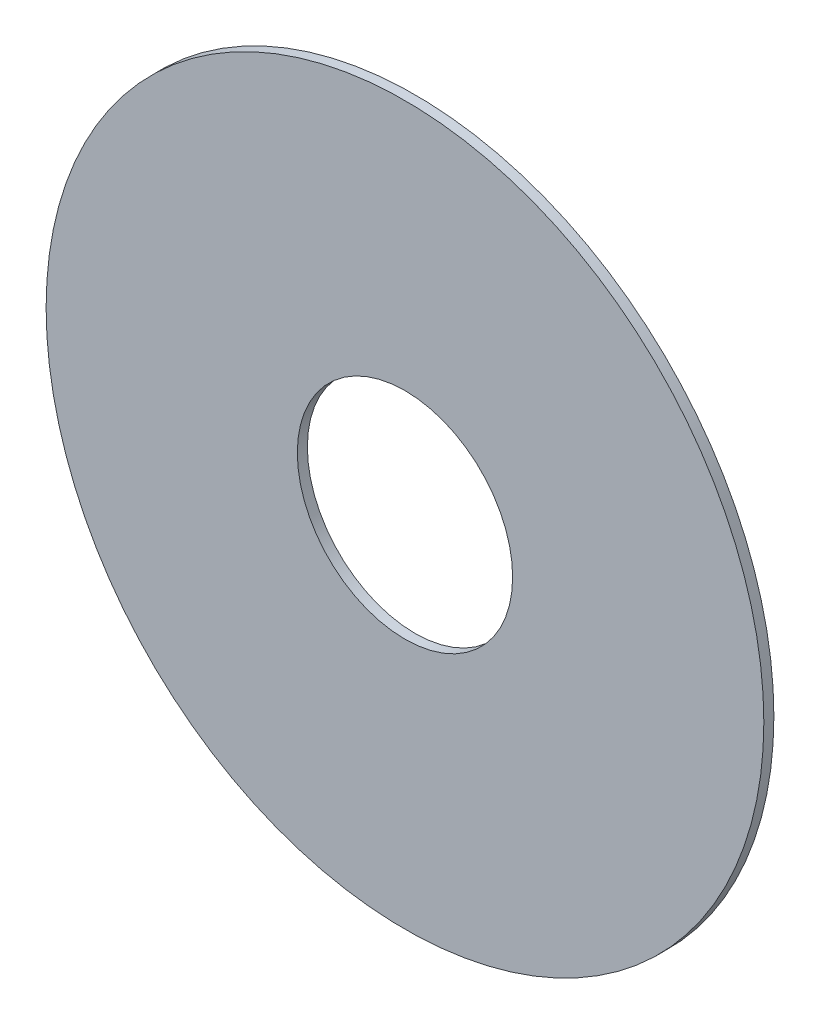
ISO-10303-21;
HEADER;
FILE_DESCRIPTION(('STEP AP214'),'2;1');
FILE_NAME('part.step','',(''),(''),'','','');
FILE_SCHEMA(('AUTOMOTIVE_DESIGN { 1 0 10303 214 1 1 1 1 }'));
ENDSEC;
DATA;
#1=APPLICATION_CONTEXT('core data for automotive mechanical design processes');
#2=APPLICATION_PROTOCOL_DEFINITION('international standard','automotive_design',2000,#1);
#3=PRODUCT_CONTEXT('',#1,'mechanical');
#4=PRODUCT('Part','Part','',(#3));
#5=PRODUCT_RELATED_PRODUCT_CATEGORY('part','',(#4));
#6=PRODUCT_DEFINITION_FORMATION('','',#4);
#7=PRODUCT_DEFINITION_CONTEXT('part definition',#1,'design');
#8=PRODUCT_DEFINITION('design','',#6,#7);
#9=PRODUCT_DEFINITION_SHAPE('','',#8);
#10=(LENGTH_UNIT() NAMED_UNIT(*) SI_UNIT(.MILLI.,.METRE.));
#11=(NAMED_UNIT(*) PLANE_ANGLE_UNIT() SI_UNIT($,.RADIAN.));
#12=(NAMED_UNIT(*) SI_UNIT($,.STERADIAN.) SOLID_ANGLE_UNIT());
#13=UNCERTAINTY_MEASURE_WITH_UNIT(LENGTH_MEASURE(1.E-05),#10,'distance_accuracy_value','');
#14=(GEOMETRIC_REPRESENTATION_CONTEXT(3) GLOBAL_UNCERTAINTY_ASSIGNED_CONTEXT((#13)) GLOBAL_UNIT_ASSIGNED_CONTEXT((#10,
#11,#12)) REPRESENTATION_CONTEXT('',''));
#15=CARTESIAN_POINT('',(0.,0.,0.));
#16=DIRECTION('',(0.,0.,1.));
#17=DIRECTION('',(1.,0.,0.));
#18=AXIS2_PLACEMENT_3D('',#15,#16,#17);
#19=CARTESIAN_POINT('',(173.228,-112.776,-0.045));
#20=DIRECTION('',(0.,0.,-1.));
#21=DIRECTION('',(0.,-1.,0.));
#22=AXIS2_PLACEMENT_3D('',#19,#20,#21);
#23=CYLINDRICAL_SURFACE('',#22,0.375);
#24=CARTESIAN_POINT('',(173.228,-112.776,-0.035));
#25=DIRECTION('',(0.,0.,-1.));
#26=DIRECTION('',(0.,-1.,0.));
#27=AXIS2_PLACEMENT_3D('',#24,#25,#26);
#28=CIRCLE('',#27,0.375);
#29=CARTESIAN_POINT('',(173.228,-113.151,-0.035));
#30=VERTEX_POINT('',#29);
#31=EDGE_CURVE('E25',#30,#30,#28,.T.);
#32=ORIENTED_EDGE('',*,*,#31,.T.);
#33=DIRECTION('',(0.,0.,1.));
#34=VECTOR('',#33,1.);
#35=CARTESIAN_POINT('',(173.228,-113.151,-0.045));
#36=LINE('',#35,#34);
#37=CARTESIAN_POINT('',(173.228,-113.151,0.));
#38=VERTEX_POINT('',#37);
#39=EDGE_CURVE('E11',#30,#38,#36,.T.);
#40=ORIENTED_EDGE('',*,*,#39,.T.);
#41=CARTESIAN_POINT('',(173.228,-112.776,0.));
#42=DIRECTION('',(0.,0.,-1.));
#43=DIRECTION('',(0.,-1.,0.));
#44=AXIS2_PLACEMENT_3D('',#41,#42,#43);
#45=CIRCLE('',#44,0.375);
#46=EDGE_CURVE('E67',#38,#38,#45,.T.);
#47=ORIENTED_EDGE('',*,*,#46,.F.);
#48=ORIENTED_EDGE('',*,*,#39,.F.);
#49=EDGE_LOOP('',(#32,#40,#47,#48));
#50=FACE_BOUND('',#49,.T.);
#51=ADVANCED_FACE('F17',(#50),#23,.F.);
#52=CARTESIAN_POINT('',(173.228,-112.776,-0.035));
#53=DIRECTION('',(0.,0.,1.));
#54=DIRECTION('',(1.,0.,0.));
#55=AXIS2_PLACEMENT_3D('',#52,#53,#54);
#56=PLANE('',#55);
#57=ORIENTED_EDGE('',*,*,#31,.F.);
#58=EDGE_LOOP('',(#57));
#59=FACE_BOUND('',#58,.T.);
#60=CARTESIAN_POINT('',(173.228,-112.776,-0.035));
#61=DIRECTION('',(0.,0.,1.));
#62=DIRECTION('',(1.,0.,0.));
#63=AXIS2_PLACEMENT_3D('',#60,#61,#62);
#64=CIRCLE('',#63,1.25);
#65=CARTESIAN_POINT('',(174.478,-112.776,-0.035));
#66=VERTEX_POINT('',#65);
#67=EDGE_CURVE('E56',#66,#66,#64,.T.);
#68=ORIENTED_EDGE('',*,*,#67,.F.);
#69=EDGE_LOOP('',(#68));
#70=FACE_BOUND('',#69,.T.);
#71=ADVANCED_FACE('F76',(#59,#70),#56,.F.);
#72=CARTESIAN_POINT('',(173.228,-112.776,0.));
#73=DIRECTION('',(0.,0.,1.));
#74=DIRECTION('',(1.,0.,0.));
#75=AXIS2_PLACEMENT_3D('',#72,#73,#74);
#76=PLANE('',#75);
#77=ORIENTED_EDGE('',*,*,#46,.T.);
#78=EDGE_LOOP('',(#77));
#79=FACE_BOUND('',#78,.T.);
#80=CARTESIAN_POINT('',(173.228,-112.776,0.));
#81=DIRECTION('',(0.,0.,1.));
#82=DIRECTION('',(1.,0.,0.));
#83=AXIS2_PLACEMENT_3D('',#80,#81,#82);
#84=CIRCLE('',#83,1.25);
#85=CARTESIAN_POINT('',(174.478,-112.776,0.));
#86=VERTEX_POINT('',#85);
#87=EDGE_CURVE('E54',#86,#86,#84,.T.);
#88=ORIENTED_EDGE('',*,*,#87,.T.);
#89=EDGE_LOOP('',(#88));
#90=FACE_BOUND('',#89,.T.);
#91=ADVANCED_FACE('F60',(#79,#90),#76,.T.);
#92=CARTESIAN_POINT('',(173.228,-112.776,-0.035));
#93=DIRECTION('',(0.,0.,1.));
#94=DIRECTION('',(1.,0.,0.));
#95=AXIS2_PLACEMENT_3D('',#92,#93,#94);
#96=CYLINDRICAL_SURFACE('',#95,1.25);
#97=ORIENTED_EDGE('',*,*,#87,.F.);
#98=DIRECTION('',(0.,0.,1.));
#99=VECTOR('',#98,1.);
#100=CARTESIAN_POINT('',(174.478,-112.776,-0.035));
#101=LINE('',#100,#99);
#102=EDGE_CURVE('E51',#66,#86,#101,.T.);
#103=ORIENTED_EDGE('',*,*,#102,.F.);
#104=ORIENTED_EDGE('',*,*,#67,.T.);
#105=ORIENTED_EDGE('',*,*,#102,.T.);
#106=EDGE_LOOP('',(#97,#103,#104,#105));
#107=FACE_BOUND('',#106,.T.);
#108=ADVANCED_FACE('F53',(#107),#96,.T.);
#109=CLOSED_SHELL('',(#51,#71,#91,#108));
#110=MANIFOLD_SOLID_BREP('B1',#109);
#111=ADVANCED_BREP_SHAPE_REPRESENTATION('',(#18,#110),#14);
#112=SHAPE_DEFINITION_REPRESENTATION(#9,#111);
ENDSEC;
END-ISO-10303-21;
